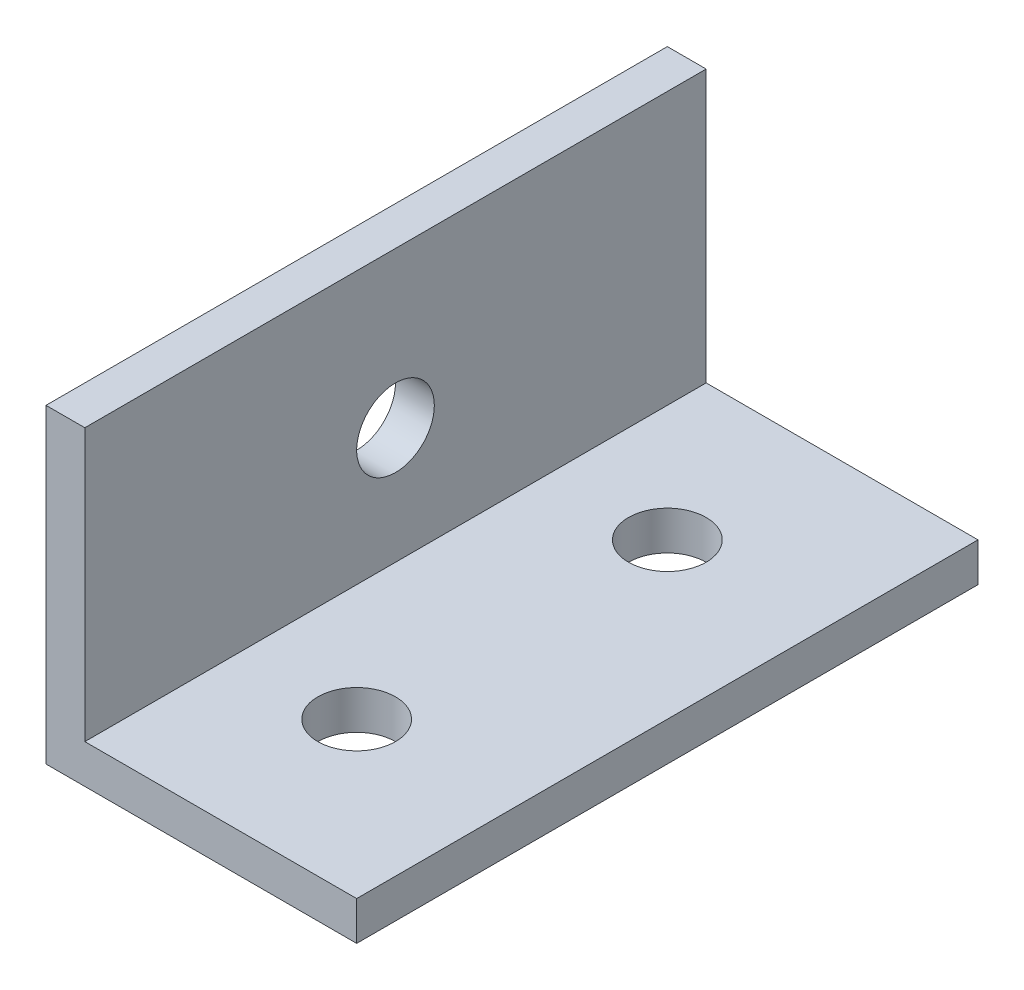
ISO-10303-21;
HEADER;
FILE_DESCRIPTION(('STEP AP214'),'2;1');
FILE_NAME('part.step','',(''),(''),'','','');
FILE_SCHEMA(('AUTOMOTIVE_DESIGN { 1 0 10303 214 1 1 1 1 }'));
ENDSEC;
DATA;
#1=APPLICATION_CONTEXT('core data for automotive mechanical design processes');
#2=APPLICATION_PROTOCOL_DEFINITION('international standard','automotive_design',2000,#1);
#3=PRODUCT_CONTEXT('',#1,'mechanical');
#4=PRODUCT('Part','Part','',(#3));
#5=PRODUCT_RELATED_PRODUCT_CATEGORY('part','',(#4));
#6=PRODUCT_DEFINITION_FORMATION('','',#4);
#7=PRODUCT_DEFINITION_CONTEXT('part definition',#1,'design');
#8=PRODUCT_DEFINITION('design','',#6,#7);
#9=PRODUCT_DEFINITION_SHAPE('','',#8);
#10=(LENGTH_UNIT() NAMED_UNIT(*) SI_UNIT(.MILLI.,.METRE.));
#11=(NAMED_UNIT(*) PLANE_ANGLE_UNIT() SI_UNIT($,.RADIAN.));
#12=(NAMED_UNIT(*) SI_UNIT($,.STERADIAN.) SOLID_ANGLE_UNIT());
#13=UNCERTAINTY_MEASURE_WITH_UNIT(LENGTH_MEASURE(1.E-05),#10,'distance_accuracy_value','');
#14=(GEOMETRIC_REPRESENTATION_CONTEXT(3) GLOBAL_UNCERTAINTY_ASSIGNED_CONTEXT((#13)) GLOBAL_UNIT_ASSIGNED_CONTEXT((#10,
#11,#12)) REPRESENTATION_CONTEXT('',''));
#15=CARTESIAN_POINT('',(0.,0.,0.));
#16=DIRECTION('',(0.,0.,1.));
#17=DIRECTION('',(1.,0.,0.));
#18=AXIS2_PLACEMENT_3D('',#15,#16,#17);
#19=CARTESIAN_POINT('',(0.,25.4,50.8));
#20=DIRECTION('',(1.,0.,0.));
#21=DIRECTION('',(0.,0.,-1.));
#22=AXIS2_PLACEMENT_3D('',#19,#20,#21);
#23=PLANE('',#22);
#24=CARTESIAN_POINT('',(0.,12.7,25.4));
#25=DIRECTION('',(1.,0.,0.));
#26=DIRECTION('',(0.,0.,-1.));
#27=AXIS2_PLACEMENT_3D('',#24,#25,#26);
#28=CIRCLE('',#27,3.175);
#29=CARTESIAN_POINT('',(0.,12.7,22.225));
#30=VERTEX_POINT('',#29);
#31=EDGE_CURVE('E123',#30,#30,#28,.T.);
#32=ORIENTED_EDGE('',*,*,#31,.T.);
#33=EDGE_LOOP('',(#32));
#34=FACE_BOUND('',#33,.T.);
#35=DIRECTION('',(0.,-1.,0.));
#36=VECTOR('',#35,1.);
#37=CARTESIAN_POINT('',(0.,25.4,0.));
#38=LINE('',#37,#36);
#39=CARTESIAN_POINT('',(0.,25.4,0.));
#40=VERTEX_POINT('',#39);
#41=CARTESIAN_POINT('',(0.,0.,0.));
#42=VERTEX_POINT('',#41);
#43=EDGE_CURVE('E119',#40,#42,#38,.T.);
#44=ORIENTED_EDGE('',*,*,#43,.T.);
#45=DIRECTION('',(0.,0.,-1.));
#46=VECTOR('',#45,1.);
#47=CARTESIAN_POINT('',(0.,0.,50.8));
#48=LINE('',#47,#46);
#49=CARTESIAN_POINT('',(0.,0.,50.8));
#50=VERTEX_POINT('',#49);
#51=EDGE_CURVE('E11',#50,#42,#48,.T.);
#52=ORIENTED_EDGE('',*,*,#51,.F.);
#53=DIRECTION('',(0.,-1.,0.));
#54=VECTOR('',#53,1.);
#55=CARTESIAN_POINT('',(0.,25.4,50.8));
#56=LINE('',#55,#54);
#57=CARTESIAN_POINT('',(0.,25.4,50.8));
#58=VERTEX_POINT('',#57);
#59=EDGE_CURVE('E130',#58,#50,#56,.T.);
#60=ORIENTED_EDGE('',*,*,#59,.F.);
#61=DIRECTION('',(0.,0.,-1.));
#62=VECTOR('',#61,1.);
#63=CARTESIAN_POINT('',(0.,25.4,50.8));
#64=LINE('',#63,#62);
#65=EDGE_CURVE('E115',#58,#40,#64,.T.);
#66=ORIENTED_EDGE('',*,*,#65,.T.);
#67=EDGE_LOOP('',(#44,#52,#60,#66));
#68=FACE_BOUND('',#67,.T.);
#69=ADVANCED_FACE('F35',(#34,#68),#23,.F.);
#70=CARTESIAN_POINT('',(0.,0.,50.8));
#71=DIRECTION('',(0.,1.,0.));
#72=DIRECTION('',(0.,0.,1.));
#73=AXIS2_PLACEMENT_3D('',#70,#71,#72);
#74=PLANE('',#73);
#75=CARTESIAN_POINT('',(12.7,0.,38.1));
#76=DIRECTION('',(0.,1.,0.));
#77=DIRECTION('',(-1.,0.,0.));
#78=AXIS2_PLACEMENT_3D('',#75,#76,#77);
#79=CIRCLE('',#78,3.175);
#80=CARTESIAN_POINT('',(9.525,0.,38.1));
#81=VERTEX_POINT('',#80);
#82=EDGE_CURVE('E167',#81,#81,#79,.T.);
#83=ORIENTED_EDGE('',*,*,#82,.T.);
#84=EDGE_LOOP('',(#83));
#85=FACE_BOUND('',#84,.T.);
#86=CARTESIAN_POINT('',(12.7,0.,12.7));
#87=DIRECTION('',(0.,1.,0.));
#88=DIRECTION('',(-1.,0.,0.));
#89=AXIS2_PLACEMENT_3D('',#86,#87,#88);
#90=CIRCLE('',#89,3.175);
#91=CARTESIAN_POINT('',(9.525,0.,12.7));
#92=VERTEX_POINT('',#91);
#93=EDGE_CURVE('E175',#92,#92,#90,.T.);
#94=ORIENTED_EDGE('',*,*,#93,.T.);
#95=EDGE_LOOP('',(#94));
#96=FACE_BOUND('',#95,.T.);
#97=DIRECTION('',(1.,0.,0.));
#98=VECTOR('',#97,1.);
#99=CARTESIAN_POINT('',(0.,0.,0.));
#100=LINE('',#99,#98);
#101=CARTESIAN_POINT('',(25.4,0.,0.));
#102=VERTEX_POINT('',#101);
#103=EDGE_CURVE('E122',#42,#102,#100,.T.);
#104=ORIENTED_EDGE('',*,*,#103,.T.);
#105=DIRECTION('',(0.,0.,-1.));
#106=VECTOR('',#105,1.);
#107=CARTESIAN_POINT('',(25.4,0.,50.8));
#108=LINE('',#107,#106);
#109=CARTESIAN_POINT('',(25.4,0.,50.8));
#110=VERTEX_POINT('',#109);
#111=EDGE_CURVE('E43',#110,#102,#108,.T.);
#112=ORIENTED_EDGE('',*,*,#111,.F.);
#113=DIRECTION('',(1.,0.,0.));
#114=VECTOR('',#113,1.);
#115=CARTESIAN_POINT('',(0.,0.,50.8));
#116=LINE('',#115,#114);
#117=EDGE_CURVE('E88',#50,#110,#116,.T.);
#118=ORIENTED_EDGE('',*,*,#117,.F.);
#119=ORIENTED_EDGE('',*,*,#51,.T.);
#120=EDGE_LOOP('',(#104,#112,#118,#119));
#121=FACE_BOUND('',#120,.T.);
#122=ADVANCED_FACE('F155',(#85,#96,#121),#74,.F.);
#123=CARTESIAN_POINT('',(25.4,0.,50.8));
#124=DIRECTION('',(-1.,0.,0.));
#125=DIRECTION('',(0.,0.,1.));
#126=AXIS2_PLACEMENT_3D('',#123,#124,#125);
#127=PLANE('',#126);
#128=DIRECTION('',(0.,1.,0.));
#129=VECTOR('',#128,1.);
#130=CARTESIAN_POINT('',(25.4,0.,0.));
#131=LINE('',#130,#129);
#132=CARTESIAN_POINT('',(25.4,3.175,0.));
#133=VERTEX_POINT('',#132);
#134=EDGE_CURVE('E125',#102,#133,#131,.T.);
#135=ORIENTED_EDGE('',*,*,#134,.T.);
#136=DIRECTION('',(0.,0.,-1.));
#137=VECTOR('',#136,1.);
#138=CARTESIAN_POINT('',(25.4,3.175,50.8));
#139=LINE('',#138,#137);
#140=CARTESIAN_POINT('',(25.4,3.175,50.8));
#141=VERTEX_POINT('',#140);
#142=EDGE_CURVE('E110',#141,#133,#139,.T.);
#143=ORIENTED_EDGE('',*,*,#142,.F.);
#144=DIRECTION('',(0.,1.,0.));
#145=VECTOR('',#144,1.);
#146=CARTESIAN_POINT('',(25.4,0.,50.8));
#147=LINE('',#146,#145);
#148=EDGE_CURVE('E101',#110,#141,#147,.T.);
#149=ORIENTED_EDGE('',*,*,#148,.F.);
#150=ORIENTED_EDGE('',*,*,#111,.T.);
#151=EDGE_LOOP('',(#135,#143,#149,#150));
#152=FACE_BOUND('',#151,.T.);
#153=ADVANCED_FACE('F136',(#152),#127,.F.);
#154=CARTESIAN_POINT('',(25.4,3.175,50.8));
#155=DIRECTION('',(0.,-1.,0.));
#156=DIRECTION('',(1.,0.,0.));
#157=AXIS2_PLACEMENT_3D('',#154,#155,#156);
#158=PLANE('',#157);
#159=CARTESIAN_POINT('',(12.7,3.175,38.1));
#160=DIRECTION('',(0.,1.,0.));
#161=DIRECTION('',(-1.,0.,0.));
#162=AXIS2_PLACEMENT_3D('',#159,#160,#161);
#163=CIRCLE('',#162,3.175);
#164=CARTESIAN_POINT('',(9.525,3.175,38.1));
#165=VERTEX_POINT('',#164);
#166=EDGE_CURVE('E178',#165,#165,#163,.T.);
#167=ORIENTED_EDGE('',*,*,#166,.F.);
#168=EDGE_LOOP('',(#167));
#169=FACE_BOUND('',#168,.T.);
#170=CARTESIAN_POINT('',(12.7,3.175,12.7));
#171=DIRECTION('',(0.,1.,0.));
#172=DIRECTION('',(-1.,0.,0.));
#173=AXIS2_PLACEMENT_3D('',#170,#171,#172);
#174=CIRCLE('',#173,3.175);
#175=CARTESIAN_POINT('',(9.525,3.175,12.7));
#176=VERTEX_POINT('',#175);
#177=EDGE_CURVE('E170',#176,#176,#174,.T.);
#178=ORIENTED_EDGE('',*,*,#177,.F.);
#179=EDGE_LOOP('',(#178));
#180=FACE_BOUND('',#179,.T.);
#181=DIRECTION('',(-1.,0.,0.));
#182=VECTOR('',#181,1.);
#183=CARTESIAN_POINT('',(25.4,3.175,0.));
#184=LINE('',#183,#182);
#185=CARTESIAN_POINT('',(3.175,3.175,0.));
#186=VERTEX_POINT('',#185);
#187=EDGE_CURVE('E109',#133,#186,#184,.T.);
#188=ORIENTED_EDGE('',*,*,#187,.T.);
#189=DIRECTION('',(0.,0.,-1.));
#190=VECTOR('',#189,1.);
#191=CARTESIAN_POINT('',(3.175,3.175,50.8));
#192=LINE('',#191,#190);
#193=CARTESIAN_POINT('',(3.175,3.175,50.8));
#194=VERTEX_POINT('',#193);
#195=EDGE_CURVE('E106',#194,#186,#192,.T.);
#196=ORIENTED_EDGE('',*,*,#195,.F.);
#197=DIRECTION('',(-1.,0.,0.));
#198=VECTOR('',#197,1.);
#199=CARTESIAN_POINT('',(25.4,3.175,50.8));
#200=LINE('',#199,#198);
#201=EDGE_CURVE('E95',#141,#194,#200,.T.);
#202=ORIENTED_EDGE('',*,*,#201,.F.);
#203=ORIENTED_EDGE('',*,*,#142,.T.);
#204=EDGE_LOOP('',(#188,#196,#202,#203));
#205=FACE_BOUND('',#204,.T.);
#206=ADVANCED_FACE('F107',(#169,#180,#205),#158,.F.);
#207=CARTESIAN_POINT('',(3.175,3.175,50.8));
#208=DIRECTION('',(-1.,0.,0.));
#209=DIRECTION('',(0.,0.,1.));
#210=AXIS2_PLACEMENT_3D('',#207,#208,#209);
#211=PLANE('',#210);
#212=CARTESIAN_POINT('',(3.175,12.7,25.4));
#213=DIRECTION('',(1.,0.,0.));
#214=DIRECTION('',(0.,0.,-1.));
#215=AXIS2_PLACEMENT_3D('',#212,#213,#214);
#216=CIRCLE('',#215,3.175);
#217=CARTESIAN_POINT('',(3.175,12.7,22.225));
#218=VERTEX_POINT('',#217);
#219=EDGE_CURVE('E164',#218,#218,#216,.T.);
#220=ORIENTED_EDGE('',*,*,#219,.F.);
#221=EDGE_LOOP('',(#220));
#222=FACE_BOUND('',#221,.T.);
#223=DIRECTION('',(0.,1.,0.));
#224=VECTOR('',#223,1.);
#225=CARTESIAN_POINT('',(3.175,3.175,0.));
#226=LINE('',#225,#224);
#227=CARTESIAN_POINT('',(3.175,25.4,0.));
#228=VERTEX_POINT('',#227);
#229=EDGE_CURVE('E74',#186,#228,#226,.T.);
#230=ORIENTED_EDGE('',*,*,#229,.T.);
#231=DIRECTION('',(0.,0.,-1.));
#232=VECTOR('',#231,1.);
#233=CARTESIAN_POINT('',(3.175,25.4,50.8));
#234=LINE('',#233,#232);
#235=CARTESIAN_POINT('',(3.175,25.4,50.8));
#236=VERTEX_POINT('',#235);
#237=EDGE_CURVE('E111',#236,#228,#234,.T.);
#238=ORIENTED_EDGE('',*,*,#237,.F.);
#239=DIRECTION('',(0.,1.,0.));
#240=VECTOR('',#239,1.);
#241=CARTESIAN_POINT('',(3.175,3.175,50.8));
#242=LINE('',#241,#240);
#243=EDGE_CURVE('E99',#194,#236,#242,.T.);
#244=ORIENTED_EDGE('',*,*,#243,.F.);
#245=ORIENTED_EDGE('',*,*,#195,.T.);
#246=EDGE_LOOP('',(#230,#238,#244,#245));
#247=FACE_BOUND('',#246,.T.);
#248=ADVANCED_FACE('F113',(#222,#247),#211,.F.);
#249=CARTESIAN_POINT('',(3.175,25.4,50.8));
#250=DIRECTION('',(0.,-1.,0.));
#251=DIRECTION('',(0.,0.,-1.));
#252=AXIS2_PLACEMENT_3D('',#249,#250,#251);
#253=PLANE('',#252);
#254=DIRECTION('',(-1.,0.,0.));
#255=VECTOR('',#254,1.);
#256=CARTESIAN_POINT('',(3.175,25.4,0.));
#257=LINE('',#256,#255);
#258=EDGE_CURVE('E80',#228,#40,#257,.T.);
#259=ORIENTED_EDGE('',*,*,#258,.T.);
#260=ORIENTED_EDGE('',*,*,#65,.F.);
#261=DIRECTION('',(-1.,0.,0.));
#262=VECTOR('',#261,1.);
#263=CARTESIAN_POINT('',(3.175,25.4,50.8));
#264=LINE('',#263,#262);
#265=EDGE_CURVE('E51',#236,#58,#264,.T.);
#266=ORIENTED_EDGE('',*,*,#265,.F.);
#267=ORIENTED_EDGE('',*,*,#237,.T.);
#268=EDGE_LOOP('',(#259,#260,#266,#267));
#269=FACE_BOUND('',#268,.T.);
#270=ADVANCED_FACE('F143',(#269),#253,.F.);
#271=CARTESIAN_POINT('',(0.,0.,50.8));
#272=DIRECTION('',(0.,0.,1.));
#273=DIRECTION('',(1.,0.,0.));
#274=AXIS2_PLACEMENT_3D('',#271,#272,#273);
#275=PLANE('',#274);
#276=ORIENTED_EDGE('',*,*,#59,.T.);
#277=ORIENTED_EDGE('',*,*,#117,.T.);
#278=ORIENTED_EDGE('',*,*,#148,.T.);
#279=ORIENTED_EDGE('',*,*,#201,.T.);
#280=ORIENTED_EDGE('',*,*,#243,.T.);
#281=ORIENTED_EDGE('',*,*,#265,.T.);
#282=EDGE_LOOP('',(#276,#277,#278,#279,#280,#281));
#283=FACE_BOUND('',#282,.T.);
#284=ADVANCED_FACE('F97',(#283),#275,.T.);
#285=CARTESIAN_POINT('',(0.,0.,0.));
#286=DIRECTION('',(0.,0.,1.));
#287=DIRECTION('',(1.,0.,0.));
#288=AXIS2_PLACEMENT_3D('',#285,#286,#287);
#289=PLANE('',#288);
#290=ORIENTED_EDGE('',*,*,#43,.F.);
#291=ORIENTED_EDGE('',*,*,#258,.F.);
#292=ORIENTED_EDGE('',*,*,#229,.F.);
#293=ORIENTED_EDGE('',*,*,#187,.F.);
#294=ORIENTED_EDGE('',*,*,#134,.F.);
#295=ORIENTED_EDGE('',*,*,#103,.F.);
#296=EDGE_LOOP('',(#290,#291,#292,#293,#294,#295));
#297=FACE_BOUND('',#296,.T.);
#298=ADVANCED_FACE('F139',(#297),#289,.F.);
#299=CARTESIAN_POINT('',(0.,12.7,25.4));
#300=DIRECTION('',(1.,0.,0.));
#301=DIRECTION('',(0.,0.,-1.));
#302=AXIS2_PLACEMENT_3D('',#299,#300,#301);
#303=CYLINDRICAL_SURFACE('',#302,3.175);
#304=ORIENTED_EDGE('',*,*,#31,.F.);
#305=EDGE_LOOP('',(#304));
#306=FACE_BOUND('',#305,.T.);
#307=ORIENTED_EDGE('',*,*,#219,.T.);
#308=EDGE_LOOP('',(#307));
#309=FACE_BOUND('',#308,.T.);
#310=ADVANCED_FACE('F198',(#306,#309),#303,.F.);
#311=CARTESIAN_POINT('',(12.7,0.,12.7));
#312=DIRECTION('',(0.,1.,0.));
#313=DIRECTION('',(-1.,0.,0.));
#314=AXIS2_PLACEMENT_3D('',#311,#312,#313);
#315=CYLINDRICAL_SURFACE('',#314,3.175);
#316=ORIENTED_EDGE('',*,*,#93,.F.);
#317=EDGE_LOOP('',(#316));
#318=FACE_BOUND('',#317,.T.);
#319=ORIENTED_EDGE('',*,*,#177,.T.);
#320=EDGE_LOOP('',(#319));
#321=FACE_BOUND('',#320,.T.);
#322=ADVANCED_FACE('F188',(#318,#321),#315,.F.);
#323=CARTESIAN_POINT('',(12.7,0.,38.1));
#324=DIRECTION('',(0.,1.,0.));
#325=DIRECTION('',(-1.,0.,0.));
#326=AXIS2_PLACEMENT_3D('',#323,#324,#325);
#327=CYLINDRICAL_SURFACE('',#326,3.175);
#328=ORIENTED_EDGE('',*,*,#82,.F.);
#329=EDGE_LOOP('',(#328));
#330=FACE_BOUND('',#329,.T.);
#331=ORIENTED_EDGE('',*,*,#166,.T.);
#332=EDGE_LOOP('',(#331));
#333=FACE_BOUND('',#332,.T.);
#334=ADVANCED_FACE('F185',(#330,#333),#327,.F.);
#335=CLOSED_SHELL('',(#69,#122,#153,#206,#248,#270,#284,#298,#310,#322,#334));
#336=MANIFOLD_SOLID_BREP('B2',#335);
#337=ADVANCED_BREP_SHAPE_REPRESENTATION('',(#18,#336),#14);
#338=SHAPE_DEFINITION_REPRESENTATION(#9,#337);
ENDSEC;
END-ISO-10303-21;
